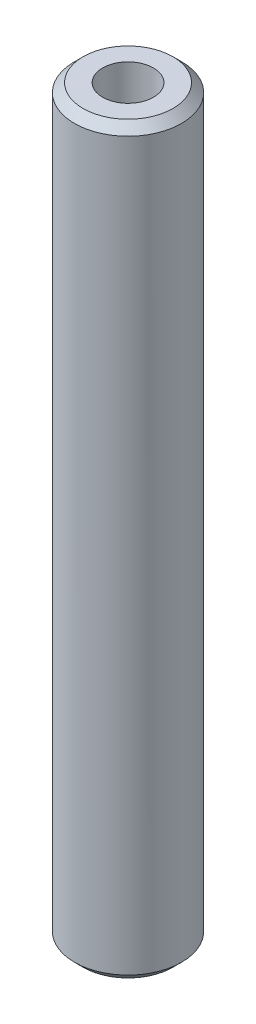
ISO-10303-21;
HEADER;
FILE_DESCRIPTION(('STEP AP214'),'2;1');
FILE_NAME('part.step','',(''),(''),'','','');
FILE_SCHEMA(('AUTOMOTIVE_DESIGN { 1 0 10303 214 1 1 1 1 }'));
ENDSEC;
DATA;
#1=APPLICATION_CONTEXT('core data for automotive mechanical design processes');
#2=APPLICATION_PROTOCOL_DEFINITION('international standard','automotive_design',2000,#1);
#3=PRODUCT_CONTEXT('',#1,'mechanical');
#4=PRODUCT('Part','Part','',(#3));
#5=PRODUCT_RELATED_PRODUCT_CATEGORY('part','',(#4));
#6=PRODUCT_DEFINITION_FORMATION('','',#4);
#7=PRODUCT_DEFINITION_CONTEXT('part definition',#1,'design');
#8=PRODUCT_DEFINITION('design','',#6,#7);
#9=PRODUCT_DEFINITION_SHAPE('','',#8);
#10=(LENGTH_UNIT() NAMED_UNIT(*) SI_UNIT(.MILLI.,.METRE.));
#11=(NAMED_UNIT(*) PLANE_ANGLE_UNIT() SI_UNIT($,.RADIAN.));
#12=(NAMED_UNIT(*) SI_UNIT($,.STERADIAN.) SOLID_ANGLE_UNIT());
#13=UNCERTAINTY_MEASURE_WITH_UNIT(LENGTH_MEASURE(1.E-05),#10,'distance_accuracy_value','');
#14=(GEOMETRIC_REPRESENTATION_CONTEXT(3) GLOBAL_UNCERTAINTY_ASSIGNED_CONTEXT((#13)) GLOBAL_UNIT_ASSIGNED_CONTEXT((#10,
#11,#12)) REPRESENTATION_CONTEXT('',''));
#15=CARTESIAN_POINT('',(0.,0.,0.));
#16=DIRECTION('',(0.,0.,1.));
#17=DIRECTION('',(1.,0.,0.));
#18=AXIS2_PLACEMENT_3D('',#15,#16,#17);
#19=CARTESIAN_POINT('',(0.,312.606610410113,0.));
#20=DIRECTION('',(0.,-1.,0.));
#21=DIRECTION('',(0.,0.,-1.));
#22=AXIS2_PLACEMENT_3D('',#19,#20,#21);
#23=CYLINDRICAL_SURFACE('',#22,22.5);
#24=CARTESIAN_POINT('',(0.,308.980454663212,0.));
#25=DIRECTION('',(0.,1.,0.));
#26=DIRECTION('',(0.,0.,1.));
#27=AXIS2_PLACEMENT_3D('',#24,#25,#26);
#28=CIRCLE('',#27,22.5);
#29=CARTESIAN_POINT('',(0.,308.980454663212,-22.5));
#30=VERTEX_POINT('',#29);
#31=EDGE_CURVE('E50',#30,#30,#28,.F.);
#32=CARTESIAN_POINT('',(0.,3.62615574690167,0.));
#33=DIRECTION('',(0.,1.,0.));
#34=DIRECTION('',(0.,0.,1.));
#35=AXIS2_PLACEMENT_3D('',#32,#33,#34);
#36=CIRCLE('',#35,22.5);
#37=CARTESIAN_POINT('',(0.,3.62615574690162,-22.5));
#38=VERTEX_POINT('',#37);
#39=EDGE_CURVE('E51',#38,#38,#36,.T.);
#40=CARTESIAN_POINT('',(0.,308.980454663212,-22.5));
#41=CARTESIAN_POINT('',(0.,305.799680716167,-22.5));
#42=CARTESIAN_POINT('',(0.,302.618906769122,-22.5));
#43=CARTESIAN_POINT('',(0.,296.257358875033,-22.5));
#44=CARTESIAN_POINT('',(0.,293.076584927988,-22.5));
#45=CARTESIAN_POINT('',(0.,286.715037033898,-22.5));
#46=CARTESIAN_POINT('',(0.,283.534263086853,-22.5));
#47=CARTESIAN_POINT('',(0.,277.172715192763,-22.5));
#48=CARTESIAN_POINT('',(0.,273.991941245718,-22.5));
#49=CARTESIAN_POINT('',(0.,267.630393351628,-22.5));
#50=CARTESIAN_POINT('',(0.,264.449619404584,-22.5));
#51=CARTESIAN_POINT('',(0.,258.088071510494,-22.5));
#52=CARTESIAN_POINT('',(0.,254.907297563449,-22.5));
#53=CARTESIAN_POINT('',(0.,248.545749669359,-22.5));
#54=CARTESIAN_POINT('',(0.,245.364975722314,-22.5));
#55=CARTESIAN_POINT('',(0.,239.003427828224,-22.5));
#56=CARTESIAN_POINT('',(0.,235.822653881179,-22.5));
#57=CARTESIAN_POINT('',(0.,229.46110598709,-22.5));
#58=CARTESIAN_POINT('',(0.,226.280332040045,-22.5));
#59=CARTESIAN_POINT('',(0.,219.918784145955,-22.5));
#60=CARTESIAN_POINT('',(0.,216.73801019891,-22.5));
#61=CARTESIAN_POINT('',(0.,210.37646230482,-22.5));
#62=CARTESIAN_POINT('',(0.,207.195688357775,-22.5));
#63=CARTESIAN_POINT('',(0.,200.834140463686,-22.5));
#64=CARTESIAN_POINT('',(0.,197.653366516641,-22.5));
#65=CARTESIAN_POINT('',(0.,191.291818622551,-22.5));
#66=CARTESIAN_POINT('',(0.,188.111044675506,-22.5));
#67=CARTESIAN_POINT('',(0.,181.749496781416,-22.5));
#68=CARTESIAN_POINT('',(0.,178.568722834371,-22.5));
#69=CARTESIAN_POINT('',(0.,172.207174940281,-22.5));
#70=CARTESIAN_POINT('',(0.,169.026400993237,-22.5));
#71=CARTESIAN_POINT('',(0.,162.664853099147,-22.5));
#72=CARTESIAN_POINT('',(0.,159.484079152102,-22.5));
#73=CARTESIAN_POINT('',(0.,153.122531258012,-22.5));
#74=CARTESIAN_POINT('',(0.,149.941757310967,-22.5));
#75=CARTESIAN_POINT('',(0.,143.580209416877,-22.5));
#76=CARTESIAN_POINT('',(0.,140.399435469832,-22.5));
#77=CARTESIAN_POINT('',(0.,134.037887575743,-22.5));
#78=CARTESIAN_POINT('',(0.,130.857113628698,-22.5));
#79=CARTESIAN_POINT('',(0.,124.495565734608,-22.5));
#80=CARTESIAN_POINT('',(0.,121.314791787563,-22.5));
#81=CARTESIAN_POINT('',(0.,114.953243893473,-22.5));
#82=CARTESIAN_POINT('',(0.,111.772469946428,-22.5));
#83=CARTESIAN_POINT('',(0.,105.410922052338,-22.5));
#84=CARTESIAN_POINT('',(0.,102.230148105294,-22.5));
#85=CARTESIAN_POINT('',(0.,95.8686002112038,-22.5));
#86=CARTESIAN_POINT('',(0.,92.6878262641589,-22.5));
#87=CARTESIAN_POINT('',(0.,86.3262783700691,-22.5));
#88=CARTESIAN_POINT('',(0.,83.1455044230242,-22.5));
#89=CARTESIAN_POINT('',(0.,76.7839565289344,-22.5));
#90=CARTESIAN_POINT('',(0.,73.6031825818895,-22.5));
#91=CARTESIAN_POINT('',(0.,67.2416346877997,-22.5));
#92=CARTESIAN_POINT('',(0.,64.0608607407548,-22.5));
#93=CARTESIAN_POINT('',(0.,57.699312846665,-22.5));
#94=CARTESIAN_POINT('',(0.,54.51853889962,-22.5));
#95=CARTESIAN_POINT('',(0.,48.1569910055302,-22.5));
#96=CARTESIAN_POINT('',(0.,44.9762170584853,-22.5));
#97=CARTESIAN_POINT('',(0.,38.6146691643955,-22.5));
#98=CARTESIAN_POINT('',(0.,35.4338952173506,-22.5));
#99=CARTESIAN_POINT('',(0.,29.0723473232608,-22.5));
#100=CARTESIAN_POINT('',(0.,25.8915733762159,-22.5));
#101=CARTESIAN_POINT('',(0.,19.5300254821261,-22.5));
#102=CARTESIAN_POINT('',(0.,16.3492515350812,-22.5));
#103=CARTESIAN_POINT('',(0.,9.9877036409914,-22.5));
#104=CARTESIAN_POINT('',(0.,6.80692969394651,-22.5));
#105=CARTESIAN_POINT('',(0.,3.62615574690162,-22.5));
#106=B_SPLINE_CURVE_WITH_KNOTS('',3,(#40,#41,#42,#43,#44,#45,#46,#47,#48,#49,#50,#51,#52,#53,
#54,#55,#56,#57,#58,#59,#60,#61,#62,#63,#64,#65,#66,#67,#68,#69,#70,#71,#72,#73,#74,#75,#76,#77,
#78,#79,#80,#81,#82,#83,#84,#85,#86,#87,#88,#89,#90,#91,#92,#93,#94,#95,#96,#97,#98,#99,#100,
#101,#102,#103,#104,#105),.UNSPECIFIED.,.F.,.F.,(4,2,2,2,2,2,2,2,2,2,2,2,2,2,2,2,2,2,2,2,2,2,2,
2,2,2,2,2,2,2,2,2,4),(0.,9.54232184113468,19.0846436822694,28.6269655234041,38.1692873645388,
47.7116092056735,57.2539310468082,66.7962528879429,76.3385747290776,85.8808965702123,
95.4232184113471,104.965540252482,114.507862093616,124.050183934751,133.592505775886,
143.134827617021,152.677149458155,162.21947129929,171.761793140425,181.304114981559,
190.846436822694,200.388758663829,209.931080504963,219.473402346098,229.015724187233,
238.558046028368,248.100367869502,257.642689710637,267.185011551772,276.727333392906,
286.269655234041,295.811977075176,305.354298916311),.UNSPECIFIED.);
#107=EDGE_CURVE('BSEAM39',#30,#38,#106,.T.);
#108=ORIENTED_EDGE('',*,*,#31,.T.);
#109=ORIENTED_EDGE('',*,*,#39,.T.);
#110=ORIENTED_EDGE('',*,*,#107,.T.);
#111=ORIENTED_EDGE('',*,*,#107,.F.);
#112=EDGE_LOOP('',(#108,#110,#109,#111));
#113=FACE_BOUND('',#112,.T.);
#114=ADVANCED_FACE('F39',(#113),#23,.T.);
#115=CARTESIAN_POINT('',(0.,312.606610410113,0.));
#116=DIRECTION('',(0.,1.,0.));
#117=DIRECTION('',(0.,0.,1.));
#118=AXIS2_PLACEMENT_3D('',#115,#116,#117);
#119=PLANE('',#118);
#120=CARTESIAN_POINT('',(0.,312.606610410113,0.));
#121=DIRECTION('',(0.,1.,0.));
#122=DIRECTION('',(0.,0.,1.));
#123=AXIS2_PLACEMENT_3D('',#120,#121,#122);
#124=CIRCLE('',#123,18.8738442530989);
#125=CARTESIAN_POINT('',(0.,312.606610410113,18.8738442530989));
#126=VERTEX_POINT('',#125);
#127=EDGE_CURVE('E54',#126,#126,#124,.T.);
#128=ORIENTED_EDGE('',*,*,#127,.T.);
#129=EDGE_LOOP('',(#128));
#130=FACE_BOUND('',#129,.T.);
#131=CARTESIAN_POINT('',(0.,312.606610410113,0.));
#132=DIRECTION('',(0.,1.,0.));
#133=DIRECTION('',(0.,0.,1.));
#134=AXIS2_PLACEMENT_3D('',#131,#132,#133);
#135=CIRCLE('',#134,10.6816877101257);
#136=CARTESIAN_POINT('',(0.,312.606610410113,-10.6816877101257));
#137=VERTEX_POINT('',#136);
#138=EDGE_CURVE('E58',#137,#137,#135,.T.);
#139=ORIENTED_EDGE('',*,*,#138,.F.);
#140=EDGE_LOOP('',(#139));
#141=FACE_BOUND('',#140,.T.);
#142=ADVANCED_FACE('F69',(#130,#141),#119,.T.);
#143=CARTESIAN_POINT('',(0.,0.,0.));
#144=DIRECTION('',(0.,1.,0.));
#145=DIRECTION('',(0.,0.,1.));
#146=AXIS2_PLACEMENT_3D('',#143,#144,#145);
#147=PLANE('',#146);
#148=CARTESIAN_POINT('',(0.,0.,0.));
#149=DIRECTION('',(0.,1.,0.));
#150=DIRECTION('',(0.,0.,1.));
#151=AXIS2_PLACEMENT_3D('',#148,#149,#150);
#152=CIRCLE('',#151,18.8738442530983);
#153=CARTESIAN_POINT('',(0.,0.,18.8738442530983));
#154=VERTEX_POINT('',#153);
#155=EDGE_CURVE('E10',#154,#154,#152,.F.);
#156=ORIENTED_EDGE('',*,*,#155,.T.);
#157=EDGE_LOOP('',(#156));
#158=FACE_BOUND('',#157,.T.);
#159=CARTESIAN_POINT('',(0.,0.,0.));
#160=DIRECTION('',(0.,1.,0.));
#161=DIRECTION('',(0.,0.,1.));
#162=AXIS2_PLACEMENT_3D('',#159,#160,#161);
#163=CIRCLE('',#162,10.6816877101257);
#164=CARTESIAN_POINT('',(0.,0.,-10.6816877101257));
#165=VERTEX_POINT('',#164);
#166=EDGE_CURVE('E63',#165,#165,#163,.T.);
#167=ORIENTED_EDGE('',*,*,#166,.T.);
#168=EDGE_LOOP('',(#167));
#169=FACE_BOUND('',#168,.T.);
#170=ADVANCED_FACE('F75',(#158,#169),#147,.F.);
#171=CARTESIAN_POINT('',(0.,312.606610410113,0.));
#172=DIRECTION('',(0.,-1.,0.));
#173=DIRECTION('',(0.,0.,-1.));
#174=AXIS2_PLACEMENT_3D('',#171,#172,#173);
#175=CYLINDRICAL_SURFACE('',#174,10.6816877101257);
#176=CARTESIAN_POINT('',(0.,312.606610410113,-10.6816877101257));
#177=CARTESIAN_POINT('',(0.,309.350291551675,-10.6816877101257));
#178=CARTESIAN_POINT('',(0.,306.093972693236,-10.6816877101257));
#179=CARTESIAN_POINT('',(0.,299.581334976359,-10.6816877101257));
#180=CARTESIAN_POINT('',(0.,296.32501611792,-10.6816877101257));
#181=CARTESIAN_POINT('',(0.,289.812378401043,-10.6816877101257));
#182=CARTESIAN_POINT('',(0.,286.556059542604,-10.6816877101257));
#183=CARTESIAN_POINT('',(0.,280.043421825727,-10.6816877101257));
#184=CARTESIAN_POINT('',(0.,276.787102967288,-10.6816877101257));
#185=CARTESIAN_POINT('',(0.,270.27446525041,-10.6816877101257));
#186=CARTESIAN_POINT('',(0.,267.018146391972,-10.6816877101257));
#187=CARTESIAN_POINT('',(0.,260.505508675094,-10.6816877101257));
#188=CARTESIAN_POINT('',(0.,257.249189816656,-10.6816877101257));
#189=CARTESIAN_POINT('',(0.,250.736552099778,-10.6816877101257));
#190=CARTESIAN_POINT('',(0.,247.48023324134,-10.6816877101257));
#191=CARTESIAN_POINT('',(0.,240.967595524462,-10.6816877101257));
#192=CARTESIAN_POINT('',(0.,237.711276666024,-10.6816877101257));
#193=CARTESIAN_POINT('',(0.,231.198638949146,-10.6816877101257));
#194=CARTESIAN_POINT('',(0.,227.942320090708,-10.6816877101257));
#195=CARTESIAN_POINT('',(0.,221.42968237383,-10.6816877101257));
#196=CARTESIAN_POINT('',(0.,218.173363515392,-10.6816877101257));
#197=CARTESIAN_POINT('',(0.,211.660725798514,-10.6816877101257));
#198=CARTESIAN_POINT('',(0.,208.404406940076,-10.6816877101257));
#199=CARTESIAN_POINT('',(0.,201.891769223198,-10.6816877101257));
#200=CARTESIAN_POINT('',(0.,198.635450364759,-10.6816877101257));
#201=CARTESIAN_POINT('',(0.,192.122812647882,-10.6816877101257));
#202=CARTESIAN_POINT('',(0.,188.866493789443,-10.6816877101257));
#203=CARTESIAN_POINT('',(0.,182.353856072566,-10.6816877101257));
#204=CARTESIAN_POINT('',(0.,179.097537214127,-10.6816877101257));
#205=CARTESIAN_POINT('',(0.,172.58489949725,-10.6816877101257));
#206=CARTESIAN_POINT('',(0.,169.328580638811,-10.6816877101257));
#207=CARTESIAN_POINT('',(0.,162.815942921934,-10.6816877101257));
#208=CARTESIAN_POINT('',(0.,159.559624063495,-10.6816877101257));
#209=CARTESIAN_POINT('',(0.,153.046986346618,-10.6816877101257));
#210=CARTESIAN_POINT('',(0.,149.790667488179,-10.6816877101257));
#211=CARTESIAN_POINT('',(0.,143.278029771302,-10.6816877101257));
#212=CARTESIAN_POINT('',(0.,140.021710912863,-10.6816877101257));
#213=CARTESIAN_POINT('',(0.,133.509073195986,-10.6816877101257));
#214=CARTESIAN_POINT('',(0.,130.252754337547,-10.6816877101257));
#215=CARTESIAN_POINT('',(0.,123.74011662067,-10.6816877101257));
#216=CARTESIAN_POINT('',(0.,120.483797762231,-10.6816877101257));
#217=CARTESIAN_POINT('',(0.,113.971160045354,-10.6816877101257));
#218=CARTESIAN_POINT('',(0.,110.714841186915,-10.6816877101257));
#219=CARTESIAN_POINT('',(0.,104.202203470038,-10.6816877101257));
#220=CARTESIAN_POINT('',(0.,100.945884611599,-10.6816877101257));
#221=CARTESIAN_POINT('',(0.,94.4332468947217,-10.6816877101257));
#222=CARTESIAN_POINT('',(0.,91.1769280362831,-10.6816877101257));
#223=CARTESIAN_POINT('',(0.,84.6642903194057,-10.6816877101257));
#224=CARTESIAN_POINT('',(0.,81.407971460967,-10.6816877101257));
#225=CARTESIAN_POINT('',(0.,74.8953337440896,-10.6816877101257));
#226=CARTESIAN_POINT('',(0.,71.639014885651,-10.6816877101257));
#227=CARTESIAN_POINT('',(0.,65.1263771687736,-10.6816877101257));
#228=CARTESIAN_POINT('',(0.,61.8700583103349,-10.6816877101257));
#229=CARTESIAN_POINT('',(0.,55.3574205934576,-10.6816877101257));
#230=CARTESIAN_POINT('',(0.,52.1011017350189,-10.6816877101257));
#231=CARTESIAN_POINT('',(0.,45.5884640181415,-10.6816877101257));
#232=CARTESIAN_POINT('',(0.,42.3321451597028,-10.6816877101257));
#233=CARTESIAN_POINT('',(0.,35.8195074428255,-10.6816877101257));
#234=CARTESIAN_POINT('',(0.,32.5631885843868,-10.6816877101257));
#235=CARTESIAN_POINT('',(0.,26.0505508675095,-10.6816877101257));
#236=CARTESIAN_POINT('',(0.,22.7942320090708,-10.6816877101257));
#237=CARTESIAN_POINT('',(0.,16.2815942921934,-10.6816877101257));
#238=CARTESIAN_POINT('',(0.,13.0252754337547,-10.6816877101257));
#239=CARTESIAN_POINT('',(0.,6.51263771687738,-10.6816877101257));
#240=CARTESIAN_POINT('',(0.,3.25631885843869,-10.6816877101257));
#241=CARTESIAN_POINT('',(0.,0.,-10.6816877101257));
#242=B_SPLINE_CURVE_WITH_KNOTS('',3,(#176,#177,#178,#179,#180,#181,#182,#183,#184,#185,#186,
#187,#188,#189,#190,#191,#192,#193,#194,#195,#196,#197,#198,#199,#200,#201,#202,#203,#204,#205,
#206,#207,#208,#209,#210,#211,#212,#213,#214,#215,#216,#217,#218,#219,#220,#221,#222,#223,#224,
#225,#226,#227,#228,#229,#230,#231,#232,#233,#234,#235,#236,#237,#238,#239,#240,#241),
.UNSPECIFIED.,.F.,.F.,(4,2,2,2,2,2,2,2,2,2,2,2,2,2,2,2,2,2,2,2,2,2,2,2,2,2,2,2,2,2,2,2,4),(0.,
9.76895657531601,19.537913150632,29.3068697259481,39.0758263012642,48.8447828765802,
58.6137394518962,68.3826960272122,78.1516526025283,87.9206091778443,97.6895657531604,
107.458522328476,117.227478903792,126.996435479108,136.765392054425,146.534348629741,
156.303305205057,166.072261780373,175.841218355689,185.610174931005,195.379131506321,
205.148088081637,214.917044656953,224.686001232269,234.454957807585,244.223914382901,
253.992870958217,263.761827533533,273.530784108849,283.299740684165,293.068697259481,
302.837653834797,312.606610410113),.UNSPECIFIED.);
#243=EDGE_CURVE('BSEAM70',#137,#165,#242,.T.);
#244=ORIENTED_EDGE('',*,*,#138,.T.);
#245=ORIENTED_EDGE('',*,*,#166,.F.);
#246=ORIENTED_EDGE('',*,*,#243,.T.);
#247=ORIENTED_EDGE('',*,*,#243,.F.);
#248=EDGE_LOOP('',(#244,#246,#245,#247));
#249=FACE_BOUND('',#248,.T.);
#250=ADVANCED_FACE('F70',(#249),#175,.F.);
#251=CARTESIAN_POINT('',(0.,312.606610410113,0.));
#252=DIRECTION('',(0.,-1.,0.));
#253=DIRECTION('',(0.,0.,-1.));
#254=AXIS2_PLACEMENT_3D('',#251,#252,#253);
#255=CONICAL_SURFACE('',#254,18.8738442530989,0.785398163397446);
#256=ORIENTED_EDGE('',*,*,#31,.F.);
#257=EDGE_LOOP('',(#256));
#258=FACE_BOUND('',#257,.T.);
#259=ORIENTED_EDGE('',*,*,#127,.F.);
#260=EDGE_LOOP('',(#259));
#261=FACE_BOUND('',#260,.T.);
#262=ADVANCED_FACE('F81',(#258,#261),#255,.T.);
#263=CARTESIAN_POINT('',(0.,3.62615574690162,0.));
#264=DIRECTION('',(0.,1.,0.));
#265=DIRECTION('',(0.,0.,1.));
#266=AXIS2_PLACEMENT_3D('',#263,#264,#265);
#267=CONICAL_SURFACE('',#266,22.5,0.785398163397454);
#268=ORIENTED_EDGE('',*,*,#155,.F.);
#269=EDGE_LOOP('',(#268));
#270=FACE_BOUND('',#269,.T.);
#271=ORIENTED_EDGE('',*,*,#39,.F.);
#272=EDGE_LOOP('',(#271));
#273=FACE_BOUND('',#272,.T.);
#274=ADVANCED_FACE('F45',(#270,#273),#267,.T.);
#275=CLOSED_SHELL('',(#114,#142,#170,#250,#262,#274));
#276=MANIFOLD_SOLID_BREP('B2',#275);
#277=ADVANCED_BREP_SHAPE_REPRESENTATION('',(#18,#276),#14);
#278=SHAPE_DEFINITION_REPRESENTATION(#9,#277);
ENDSEC;
END-ISO-10303-21;
